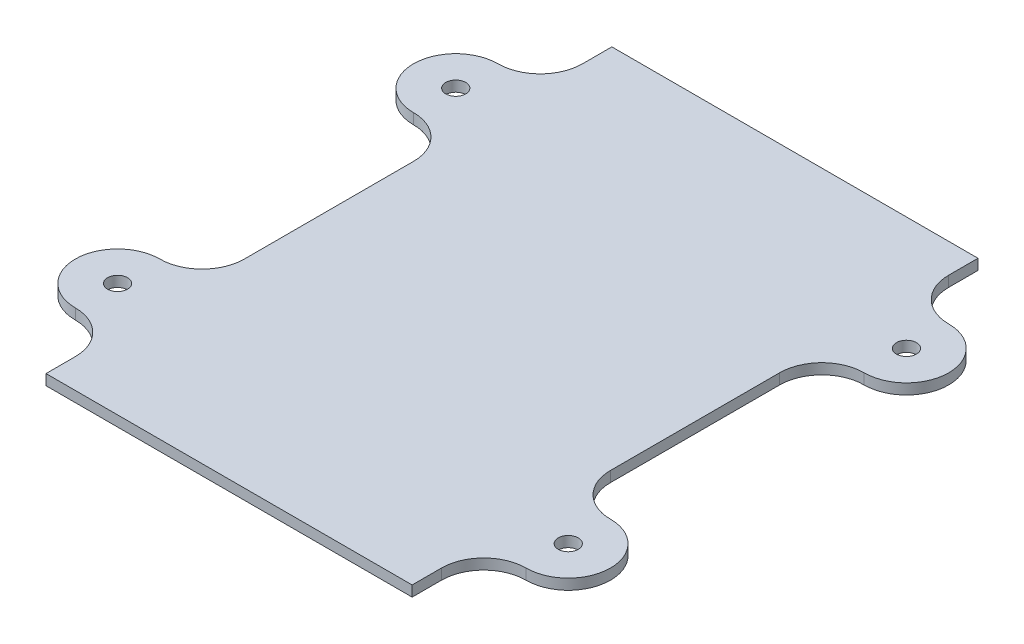
ISO-10303-21;
HEADER;
FILE_DESCRIPTION(('STEP AP214'),'2;1');
FILE_NAME('part.step','',(''),(''),'','','');
FILE_SCHEMA(('AUTOMOTIVE_DESIGN { 1 0 10303 214 1 1 1 1 }'));
ENDSEC;
DATA;
#1=APPLICATION_CONTEXT('core data for automotive mechanical design processes');
#2=APPLICATION_PROTOCOL_DEFINITION('international standard','automotive_design',2000,#1);
#3=PRODUCT_CONTEXT('',#1,'mechanical');
#4=PRODUCT('Part','Part','',(#3));
#5=PRODUCT_RELATED_PRODUCT_CATEGORY('part','',(#4));
#6=PRODUCT_DEFINITION_FORMATION('','',#4);
#7=PRODUCT_DEFINITION_CONTEXT('part definition',#1,'design');
#8=PRODUCT_DEFINITION('design','',#6,#7);
#9=PRODUCT_DEFINITION_SHAPE('','',#8);
#10=(LENGTH_UNIT() NAMED_UNIT(*) SI_UNIT(.MILLI.,.METRE.));
#11=(NAMED_UNIT(*) PLANE_ANGLE_UNIT() SI_UNIT($,.RADIAN.));
#12=(NAMED_UNIT(*) SI_UNIT($,.STERADIAN.) SOLID_ANGLE_UNIT());
#13=UNCERTAINTY_MEASURE_WITH_UNIT(LENGTH_MEASURE(1.E-05),#10,'distance_accuracy_value','');
#14=(GEOMETRIC_REPRESENTATION_CONTEXT(3) GLOBAL_UNCERTAINTY_ASSIGNED_CONTEXT((#13)) GLOBAL_UNIT_ASSIGNED_CONTEXT((#10,
#11,#12)) REPRESENTATION_CONTEXT('',''));
#15=CARTESIAN_POINT('',(0.,0.,0.));
#16=DIRECTION('',(0.,0.,1.));
#17=DIRECTION('',(1.,0.,0.));
#18=AXIS2_PLACEMENT_3D('',#15,#16,#17);
#19=CARTESIAN_POINT('',(-27.5,1.5875,42.5));
#20=DIRECTION('',(1.,0.,0.));
#21=DIRECTION('',(0.,0.,-1.));
#22=AXIS2_PLACEMENT_3D('',#19,#20,#21);
#23=PLANE('',#22);
#24=DIRECTION('',(0.,-1.,0.));
#25=VECTOR('',#24,1.);
#26=CARTESIAN_POINT('',(-27.5,1.5875,-12.7));
#27=LINE('',#26,#25);
#28=CARTESIAN_POINT('',(-27.5,1.5875,-12.7));
#29=VERTEX_POINT('',#28);
#30=CARTESIAN_POINT('',(-27.5,0.,-12.7));
#31=VERTEX_POINT('',#30);
#32=EDGE_CURVE('E197',#29,#31,#27,.T.);
#33=ORIENTED_EDGE('',*,*,#32,.T.);
#34=DIRECTION('',(0.,0.,1.));
#35=VECTOR('',#34,1.);
#36=CARTESIAN_POINT('',(-27.5,0.,42.5));
#37=LINE('',#36,#35);
#38=CARTESIAN_POINT('',(-27.5,0.,12.7));
#39=VERTEX_POINT('',#38);
#40=EDGE_CURVE('E310',#31,#39,#37,.T.);
#41=ORIENTED_EDGE('',*,*,#40,.T.);
#42=DIRECTION('',(0.,-1.,0.));
#43=VECTOR('',#42,1.);
#44=CARTESIAN_POINT('',(-27.5,1.5875,12.7));
#45=LINE('',#44,#43);
#46=CARTESIAN_POINT('',(-27.5,1.5875,12.7));
#47=VERTEX_POINT('',#46);
#48=EDGE_CURVE('E237',#47,#39,#45,.T.);
#49=ORIENTED_EDGE('',*,*,#48,.F.);
#50=DIRECTION('',(0.,0.,1.));
#51=VECTOR('',#50,1.);
#52=CARTESIAN_POINT('',(-27.5,1.5875,42.5));
#53=LINE('',#52,#51);
#54=EDGE_CURVE('E48',#29,#47,#53,.T.);
#55=ORIENTED_EDGE('',*,*,#54,.F.);
#56=EDGE_LOOP('',(#33,#41,#49,#55));
#57=FACE_BOUND('',#56,.T.);
#58=ADVANCED_FACE('F33',(#57),#23,.F.);
#59=CARTESIAN_POINT('',(-27.5,0.,-42.5));
#60=VERTEX_POINT('',#59);
#61=CARTESIAN_POINT('',(-27.5,0.,-38.1));
#62=VERTEX_POINT('',#61);
#63=EDGE_CURVE('E307',#60,#62,#37,.T.);
#64=ORIENTED_EDGE('',*,*,#63,.T.);
#65=DIRECTION('',(0.,-1.,0.));
#66=VECTOR('',#65,1.);
#67=CARTESIAN_POINT('',(-27.5,1.5875,-38.1));
#68=LINE('',#67,#66);
#69=CARTESIAN_POINT('',(-27.5,1.5875,-38.1));
#70=VERTEX_POINT('',#69);
#71=EDGE_CURVE('E56',#70,#62,#68,.T.);
#72=ORIENTED_EDGE('',*,*,#71,.F.);
#73=CARTESIAN_POINT('',(-27.5,1.5875,-42.5));
#74=VERTEX_POINT('',#73);
#75=EDGE_CURVE('E191',#74,#70,#53,.T.);
#76=ORIENTED_EDGE('',*,*,#75,.F.);
#77=DIRECTION('',(0.,-1.,0.));
#78=VECTOR('',#77,1.);
#79=CARTESIAN_POINT('',(-27.5,1.5875,-42.5));
#80=LINE('',#79,#78);
#81=EDGE_CURVE('E41',#74,#60,#80,.T.);
#82=ORIENTED_EDGE('',*,*,#81,.T.);
#83=EDGE_LOOP('',(#64,#72,#76,#82));
#84=FACE_BOUND('',#83,.T.);
#85=ADVANCED_FACE('F339',(#84),#23,.F.);
#86=CARTESIAN_POINT('',(27.5,1.5875,42.5));
#87=DIRECTION('',(-1.,0.,0.));
#88=DIRECTION('',(0.,0.,1.));
#89=AXIS2_PLACEMENT_3D('',#86,#87,#88);
#90=PLANE('',#89);
#91=DIRECTION('',(0.,-1.,0.));
#92=VECTOR('',#91,1.);
#93=CARTESIAN_POINT('',(27.5,1.5875,12.7));
#94=LINE('',#93,#92);
#95=CARTESIAN_POINT('',(27.5,1.5875,12.7));
#96=VERTEX_POINT('',#95);
#97=CARTESIAN_POINT('',(27.5,0.,12.7));
#98=VERTEX_POINT('',#97);
#99=EDGE_CURVE('E257',#96,#98,#94,.T.);
#100=ORIENTED_EDGE('',*,*,#99,.T.);
#101=DIRECTION('',(0.,0.,-1.));
#102=VECTOR('',#101,1.);
#103=CARTESIAN_POINT('',(27.5,0.,42.5));
#104=LINE('',#103,#102);
#105=CARTESIAN_POINT('',(27.5,0.,-12.7));
#106=VERTEX_POINT('',#105);
#107=EDGE_CURVE('E312',#98,#106,#104,.T.);
#108=ORIENTED_EDGE('',*,*,#107,.T.);
#109=DIRECTION('',(0.,-1.,0.));
#110=VECTOR('',#109,1.);
#111=CARTESIAN_POINT('',(27.5,1.5875,-12.7));
#112=LINE('',#111,#110);
#113=CARTESIAN_POINT('',(27.5,1.5875,-12.7));
#114=VERTEX_POINT('',#113);
#115=EDGE_CURVE('E328',#114,#106,#112,.T.);
#116=ORIENTED_EDGE('',*,*,#115,.F.);
#117=DIRECTION('',(0.,0.,-1.));
#118=VECTOR('',#117,1.);
#119=CARTESIAN_POINT('',(27.5,1.5875,42.5));
#120=LINE('',#119,#118);
#121=EDGE_CURVE('E291',#96,#114,#120,.T.);
#122=ORIENTED_EDGE('',*,*,#121,.F.);
#123=EDGE_LOOP('',(#100,#108,#116,#122));
#124=FACE_BOUND('',#123,.T.);
#125=ADVANCED_FACE('F388',(#124),#90,.F.);
#126=CARTESIAN_POINT('',(33.85,1.5875,-12.7));
#127=DIRECTION('',(0.,1.,0.));
#128=DIRECTION('',(0.,0.,1.));
#129=AXIS2_PLACEMENT_3D('',#126,#127,#128);
#130=PLANE('',#129);
#131=CARTESIAN_POINT('',(33.85,1.5875,-38.1));
#132=DIRECTION('',(0.,-1.,0.));
#133=DIRECTION('',(0.,0.,-1.));
#134=AXIS2_PLACEMENT_3D('',#131,#132,#133);
#135=CIRCLE('',#134,6.35);
#136=CARTESIAN_POINT('',(33.85,1.5875,-31.75));
#137=VERTEX_POINT('',#136);
#138=CARTESIAN_POINT('',(27.5,1.5875,-38.1));
#139=VERTEX_POINT('',#138);
#140=EDGE_CURVE('E299',#137,#139,#135,.T.);
#141=ORIENTED_EDGE('',*,*,#140,.T.);
#142=DIRECTION('',(0.,0.,-1.));
#143=VECTOR('',#142,1.);
#144=CARTESIAN_POINT('',(27.5,1.5875,-38.1));
#145=LINE('',#144,#143);
#146=CARTESIAN_POINT('',(27.5,1.5875,-42.5));
#147=VERTEX_POINT('',#146);
#148=EDGE_CURVE('E281',#139,#147,#145,.T.);
#149=ORIENTED_EDGE('',*,*,#148,.T.);
#150=DIRECTION('',(-1.,0.,0.));
#151=VECTOR('',#150,1.);
#152=CARTESIAN_POINT('',(-27.5,1.5875,-42.5));
#153=LINE('',#152,#151);
#154=EDGE_CURVE('E284',#147,#74,#153,.T.);
#155=ORIENTED_EDGE('',*,*,#154,.T.);
#156=ORIENTED_EDGE('',*,*,#75,.T.);
#157=CARTESIAN_POINT('',(-33.85,1.5875,-38.1));
#158=DIRECTION('',(0.,1.,0.));
#159=DIRECTION('',(0.,0.,-1.));
#160=AXIS2_PLACEMENT_3D('',#157,#158,#159);
#161=CIRCLE('',#160,6.35);
#162=CARTESIAN_POINT('',(-33.85,1.5875,-31.75));
#163=VERTEX_POINT('',#162);
#164=EDGE_CURVE('E175',#163,#70,#161,.T.);
#165=ORIENTED_EDGE('',*,*,#164,.F.);
#166=CARTESIAN_POINT('',(-33.85,1.5875,-25.4));
#167=DIRECTION('',(0.,-1.,0.));
#168=DIRECTION('',(0.,0.,-1.));
#169=AXIS2_PLACEMENT_3D('',#166,#167,#168);
#170=CIRCLE('',#169,6.35);
#171=CARTESIAN_POINT('',(-33.85,1.5875,-19.05));
#172=VERTEX_POINT('',#171);
#173=EDGE_CURVE('E189',#172,#163,#170,.T.);
#174=ORIENTED_EDGE('',*,*,#173,.F.);
#175=CARTESIAN_POINT('',(-33.85,1.5875,-12.7));
#176=DIRECTION('',(0.,1.,0.));
#177=DIRECTION('',(0.,0.,1.));
#178=AXIS2_PLACEMENT_3D('',#175,#176,#177);
#179=CIRCLE('',#178,6.35);
#180=EDGE_CURVE('E195',#29,#172,#179,.T.);
#181=ORIENTED_EDGE('',*,*,#180,.F.);
#182=ORIENTED_EDGE('',*,*,#54,.T.);
#183=CARTESIAN_POINT('',(-33.85,1.5875,12.7));
#184=DIRECTION('',(0.,-1.,0.));
#185=DIRECTION('',(0.,0.,-1.));
#186=AXIS2_PLACEMENT_3D('',#183,#184,#185);
#187=CIRCLE('',#186,6.35);
#188=CARTESIAN_POINT('',(-33.85,1.5875,19.05));
#189=VERTEX_POINT('',#188);
#190=EDGE_CURVE('E217',#47,#189,#187,.T.);
#191=ORIENTED_EDGE('',*,*,#190,.T.);
#192=CARTESIAN_POINT('',(-33.85,1.5875,25.4));
#193=DIRECTION('',(0.,1.,0.));
#194=DIRECTION('',(0.,0.,1.));
#195=AXIS2_PLACEMENT_3D('',#192,#193,#194);
#196=CIRCLE('',#195,6.35);
#197=CARTESIAN_POINT('',(-33.85,1.5875,31.75));
#198=VERTEX_POINT('',#197);
#199=EDGE_CURVE('E219',#189,#198,#196,.T.);
#200=ORIENTED_EDGE('',*,*,#199,.T.);
#201=CARTESIAN_POINT('',(-33.85,1.5875,38.1));
#202=DIRECTION('',(0.,-1.,0.));
#203=DIRECTION('',(0.,0.,1.));
#204=AXIS2_PLACEMENT_3D('',#201,#202,#203);
#205=CIRCLE('',#204,6.35);
#206=CARTESIAN_POINT('',(-27.5,1.5875,38.1));
#207=VERTEX_POINT('',#206);
#208=EDGE_CURVE('E222',#198,#207,#205,.T.);
#209=ORIENTED_EDGE('',*,*,#208,.T.);
#210=CARTESIAN_POINT('',(-27.5,1.5875,42.5));
#211=VERTEX_POINT('',#210);
#212=EDGE_CURVE('E287',#207,#211,#53,.T.);
#213=ORIENTED_EDGE('',*,*,#212,.T.);
#214=DIRECTION('',(1.,0.,0.));
#215=VECTOR('',#214,1.);
#216=CARTESIAN_POINT('',(-27.5,1.5875,42.5));
#217=LINE('',#216,#215);
#218=CARTESIAN_POINT('',(27.5,1.5875,42.5));
#219=VERTEX_POINT('',#218);
#220=EDGE_CURVE('E289',#211,#219,#217,.T.);
#221=ORIENTED_EDGE('',*,*,#220,.T.);
#222=CARTESIAN_POINT('',(27.5,1.5875,38.1));
#223=VERTEX_POINT('',#222);
#224=EDGE_CURVE('E292',#219,#223,#120,.T.);
#225=ORIENTED_EDGE('',*,*,#224,.T.);
#226=CARTESIAN_POINT('',(33.85,1.5875,38.1));
#227=DIRECTION('',(0.,1.,0.));
#228=DIRECTION('',(0.,0.,1.));
#229=AXIS2_PLACEMENT_3D('',#226,#227,#228);
#230=CIRCLE('',#229,6.35);
#231=CARTESIAN_POINT('',(33.85,1.5875,31.75));
#232=VERTEX_POINT('',#231);
#233=EDGE_CURVE('E247',#232,#223,#230,.T.);
#234=ORIENTED_EDGE('',*,*,#233,.F.);
#235=CARTESIAN_POINT('',(33.85,1.5875,25.4));
#236=DIRECTION('',(0.,-1.,0.));
#237=DIRECTION('',(0.,0.,1.));
#238=AXIS2_PLACEMENT_3D('',#235,#236,#237);
#239=CIRCLE('',#238,6.35);
#240=CARTESIAN_POINT('',(33.85,1.5875,19.05));
#241=VERTEX_POINT('',#240);
#242=EDGE_CURVE('E250',#241,#232,#239,.T.);
#243=ORIENTED_EDGE('',*,*,#242,.F.);
#244=CARTESIAN_POINT('',(33.85,1.5875,12.7));
#245=DIRECTION('',(0.,1.,0.));
#246=DIRECTION('',(0.,0.,-1.));
#247=AXIS2_PLACEMENT_3D('',#244,#245,#246);
#248=CIRCLE('',#247,6.35);
#249=EDGE_CURVE('E254',#96,#241,#248,.T.);
#250=ORIENTED_EDGE('',*,*,#249,.F.);
#251=ORIENTED_EDGE('',*,*,#121,.T.);
#252=CARTESIAN_POINT('',(33.85,1.5875,-12.7));
#253=DIRECTION('',(0.,-1.,0.));
#254=DIRECTION('',(0.,0.,1.));
#255=AXIS2_PLACEMENT_3D('',#252,#253,#254);
#256=CIRCLE('',#255,6.35);
#257=CARTESIAN_POINT('',(33.85,1.5875,-19.05));
#258=VERTEX_POINT('',#257);
#259=EDGE_CURVE('E295',#114,#258,#256,.T.);
#260=ORIENTED_EDGE('',*,*,#259,.T.);
#261=CARTESIAN_POINT('',(33.85,1.5875,-25.4));
#262=DIRECTION('',(0.,1.,0.));
#263=DIRECTION('',(0.,0.,-1.));
#264=AXIS2_PLACEMENT_3D('',#261,#262,#263);
#265=CIRCLE('',#264,6.35);
#266=EDGE_CURVE('E297',#258,#137,#265,.T.);
#267=ORIENTED_EDGE('',*,*,#266,.T.);
#268=EDGE_LOOP('',(#141,#149,#155,#156,#165,#174,#181,#182,#191,#200,#209,#213,#221,#225,#234,
#243,#250,#251,#260,#267));
#269=FACE_BOUND('',#268,.T.);
#270=CARTESIAN_POINT('',(33.85,1.5875,-25.4));
#271=DIRECTION('',(0.,1.,0.));
#272=DIRECTION('',(0.,0.,1.));
#273=AXIS2_PLACEMENT_3D('',#270,#271,#272);
#274=CIRCLE('',#273,1.5);
#275=CARTESIAN_POINT('',(33.85,1.5875,-23.9));
#276=VERTEX_POINT('',#275);
#277=EDGE_CURVE('E275',#276,#276,#274,.T.);
#278=ORIENTED_EDGE('',*,*,#277,.F.);
#279=EDGE_LOOP('',(#278));
#280=FACE_BOUND('',#279,.T.);
#281=CARTESIAN_POINT('',(33.85,1.5875,25.4));
#282=DIRECTION('',(0.,-1.,0.));
#283=DIRECTION('',(0.,0.,-1.));
#284=AXIS2_PLACEMENT_3D('',#281,#282,#283);
#285=CIRCLE('',#284,1.5);
#286=CARTESIAN_POINT('',(33.85,1.5875,23.9));
#287=VERTEX_POINT('',#286);
#288=EDGE_CURVE('E241',#287,#287,#285,.T.);
#289=ORIENTED_EDGE('',*,*,#288,.T.);
#290=EDGE_LOOP('',(#289));
#291=FACE_BOUND('',#290,.T.);
#292=CARTESIAN_POINT('',(-33.85,1.5875,25.4));
#293=DIRECTION('',(0.,1.,0.));
#294=DIRECTION('',(0.,0.,-1.));
#295=AXIS2_PLACEMENT_3D('',#292,#293,#294);
#296=CIRCLE('',#295,1.5);
#297=CARTESIAN_POINT('',(-33.85,1.5875,23.9));
#298=VERTEX_POINT('',#297);
#299=EDGE_CURVE('E211',#298,#298,#296,.T.);
#300=ORIENTED_EDGE('',*,*,#299,.F.);
#301=EDGE_LOOP('',(#300));
#302=FACE_BOUND('',#301,.T.);
#303=CARTESIAN_POINT('',(-33.85,1.5875,-25.4));
#304=DIRECTION('',(0.,-1.,0.));
#305=DIRECTION('',(0.,0.,1.));
#306=AXIS2_PLACEMENT_3D('',#303,#304,#305);
#307=CIRCLE('',#306,1.5);
#308=CARTESIAN_POINT('',(-33.85,1.5875,-23.9));
#309=VERTEX_POINT('',#308);
#310=EDGE_CURVE('E203',#309,#309,#307,.T.);
#311=ORIENTED_EDGE('',*,*,#310,.T.);
#312=EDGE_LOOP('',(#311));
#313=FACE_BOUND('',#312,.T.);
#314=ADVANCED_FACE('F186',(#269,#280,#291,#302,#313),#130,.T.);
#315=CARTESIAN_POINT('',(33.85,0.,-12.7));
#316=DIRECTION('',(0.,1.,0.));
#317=DIRECTION('',(0.,0.,1.));
#318=AXIS2_PLACEMENT_3D('',#315,#316,#317);
#319=PLANE('',#318);
#320=CARTESIAN_POINT('',(33.85,0.,-12.7));
#321=DIRECTION('',(0.,-1.,0.));
#322=DIRECTION('',(0.,0.,1.));
#323=AXIS2_PLACEMENT_3D('',#320,#321,#322);
#324=CIRCLE('',#323,6.35);
#325=CARTESIAN_POINT('',(33.85,0.,-19.05));
#326=VERTEX_POINT('',#325);
#327=EDGE_CURVE('E315',#106,#326,#324,.T.);
#328=ORIENTED_EDGE('',*,*,#327,.F.);
#329=ORIENTED_EDGE('',*,*,#107,.F.);
#330=CARTESIAN_POINT('',(33.85,0.,12.7));
#331=DIRECTION('',(0.,1.,0.));
#332=DIRECTION('',(0.,0.,-1.));
#333=AXIS2_PLACEMENT_3D('',#330,#331,#332);
#334=CIRCLE('',#333,6.35);
#335=CARTESIAN_POINT('',(33.85,0.,19.05));
#336=VERTEX_POINT('',#335);
#337=EDGE_CURVE('E251',#98,#336,#334,.T.);
#338=ORIENTED_EDGE('',*,*,#337,.T.);
#339=CARTESIAN_POINT('',(33.85,0.,25.4));
#340=DIRECTION('',(0.,-1.,0.));
#341=DIRECTION('',(0.,0.,1.));
#342=AXIS2_PLACEMENT_3D('',#339,#340,#341);
#343=CIRCLE('',#342,6.35);
#344=CARTESIAN_POINT('',(33.85,0.,31.75));
#345=VERTEX_POINT('',#344);
#346=EDGE_CURVE('E260',#336,#345,#343,.T.);
#347=ORIENTED_EDGE('',*,*,#346,.T.);
#348=CARTESIAN_POINT('',(33.85,0.,38.1));
#349=DIRECTION('',(0.,1.,0.));
#350=DIRECTION('',(0.,0.,1.));
#351=AXIS2_PLACEMENT_3D('',#348,#349,#350);
#352=CIRCLE('',#351,6.35);
#353=CARTESIAN_POINT('',(27.5,0.,38.1));
#354=VERTEX_POINT('',#353);
#355=EDGE_CURVE('E244',#345,#354,#352,.T.);
#356=ORIENTED_EDGE('',*,*,#355,.T.);
#357=CARTESIAN_POINT('',(27.5,0.,42.5));
#358=VERTEX_POINT('',#357);
#359=EDGE_CURVE('E313',#358,#354,#104,.T.);
#360=ORIENTED_EDGE('',*,*,#359,.F.);
#361=DIRECTION('',(1.,0.,0.));
#362=VECTOR('',#361,1.);
#363=CARTESIAN_POINT('',(-27.5,0.,42.5));
#364=LINE('',#363,#362);
#365=CARTESIAN_POINT('',(-27.5,0.,42.5));
#366=VERTEX_POINT('',#365);
#367=EDGE_CURVE('E309',#366,#358,#364,.T.);
#368=ORIENTED_EDGE('',*,*,#367,.F.);
#369=CARTESIAN_POINT('',(-27.5,0.,38.1));
#370=VERTEX_POINT('',#369);
#371=EDGE_CURVE('E306',#370,#366,#37,.T.);
#372=ORIENTED_EDGE('',*,*,#371,.F.);
#373=CARTESIAN_POINT('',(-33.85,0.,38.1));
#374=DIRECTION('',(0.,-1.,0.));
#375=DIRECTION('',(0.,0.,1.));
#376=AXIS2_PLACEMENT_3D('',#373,#374,#375);
#377=CIRCLE('',#376,6.35);
#378=CARTESIAN_POINT('',(-33.85,0.,31.75));
#379=VERTEX_POINT('',#378);
#380=EDGE_CURVE('E220',#379,#370,#377,.T.);
#381=ORIENTED_EDGE('',*,*,#380,.F.);
#382=CARTESIAN_POINT('',(-33.85,0.,25.4));
#383=DIRECTION('',(0.,1.,0.));
#384=DIRECTION('',(0.,0.,1.));
#385=AXIS2_PLACEMENT_3D('',#382,#383,#384);
#386=CIRCLE('',#385,6.35);
#387=CARTESIAN_POINT('',(-33.85,0.,19.05));
#388=VERTEX_POINT('',#387);
#389=EDGE_CURVE('E226',#388,#379,#386,.T.);
#390=ORIENTED_EDGE('',*,*,#389,.F.);
#391=CARTESIAN_POINT('',(-33.85,0.,12.7));
#392=DIRECTION('',(0.,-1.,0.));
#393=DIRECTION('',(0.,0.,-1.));
#394=AXIS2_PLACEMENT_3D('',#391,#392,#393);
#395=CIRCLE('',#394,6.35);
#396=EDGE_CURVE('E214',#39,#388,#395,.T.);
#397=ORIENTED_EDGE('',*,*,#396,.F.);
#398=ORIENTED_EDGE('',*,*,#40,.F.);
#399=CARTESIAN_POINT('',(-33.85,0.,-12.7));
#400=DIRECTION('',(0.,1.,0.));
#401=DIRECTION('',(0.,0.,1.));
#402=AXIS2_PLACEMENT_3D('',#399,#400,#401);
#403=CIRCLE('',#402,6.35);
#404=CARTESIAN_POINT('',(-33.85,0.,-19.05));
#405=VERTEX_POINT('',#404);
#406=EDGE_CURVE('E192',#31,#405,#403,.T.);
#407=ORIENTED_EDGE('',*,*,#406,.T.);
#408=CARTESIAN_POINT('',(-33.85,0.,-25.4));
#409=DIRECTION('',(0.,-1.,0.));
#410=DIRECTION('',(0.,0.,-1.));
#411=AXIS2_PLACEMENT_3D('',#408,#409,#410);
#412=CIRCLE('',#411,6.35);
#413=CARTESIAN_POINT('',(-33.85,0.,-31.75));
#414=VERTEX_POINT('',#413);
#415=EDGE_CURVE('E202',#405,#414,#412,.T.);
#416=ORIENTED_EDGE('',*,*,#415,.T.);
#417=CARTESIAN_POINT('',(-33.85,0.,-38.1));
#418=DIRECTION('',(0.,1.,0.));
#419=DIRECTION('',(0.,0.,-1.));
#420=AXIS2_PLACEMENT_3D('',#417,#418,#419);
#421=CIRCLE('',#420,6.35);
#422=EDGE_CURVE('E177',#414,#62,#421,.T.);
#423=ORIENTED_EDGE('',*,*,#422,.T.);
#424=ORIENTED_EDGE('',*,*,#63,.F.);
#425=DIRECTION('',(-1.,0.,0.));
#426=VECTOR('',#425,1.);
#427=CARTESIAN_POINT('',(-27.5,0.,-42.5));
#428=LINE('',#427,#426);
#429=CARTESIAN_POINT('',(27.5,0.,-42.5));
#430=VERTEX_POINT('',#429);
#431=EDGE_CURVE('E304',#430,#60,#428,.T.);
#432=ORIENTED_EDGE('',*,*,#431,.F.);
#433=DIRECTION('',(0.,0.,-1.));
#434=VECTOR('',#433,1.);
#435=CARTESIAN_POINT('',(27.5,0.,-38.1));
#436=LINE('',#435,#434);
#437=CARTESIAN_POINT('',(27.5,0.,-38.1));
#438=VERTEX_POINT('',#437);
#439=EDGE_CURVE('E278',#438,#430,#436,.T.);
#440=ORIENTED_EDGE('',*,*,#439,.F.);
#441=CARTESIAN_POINT('',(33.85,0.,-38.1));
#442=DIRECTION('',(0.,-1.,0.));
#443=DIRECTION('',(0.,0.,-1.));
#444=AXIS2_PLACEMENT_3D('',#441,#442,#443);
#445=CIRCLE('',#444,6.35);
#446=CARTESIAN_POINT('',(33.85,0.,-31.75));
#447=VERTEX_POINT('',#446);
#448=EDGE_CURVE('E285',#447,#438,#445,.T.);
#449=ORIENTED_EDGE('',*,*,#448,.F.);
#450=CARTESIAN_POINT('',(33.85,0.,-25.4));
#451=DIRECTION('',(0.,1.,0.));
#452=DIRECTION('',(0.,0.,-1.));
#453=AXIS2_PLACEMENT_3D('',#450,#451,#452);
#454=CIRCLE('',#453,6.35);
#455=EDGE_CURVE('E317',#326,#447,#454,.T.);
#456=ORIENTED_EDGE('',*,*,#455,.F.);
#457=EDGE_LOOP('',(#328,#329,#338,#347,#356,#360,#368,#372,#381,#390,#397,#398,#407,#416,#423,
#424,#432,#440,#449,#456));
#458=FACE_BOUND('',#457,.T.);
#459=CARTESIAN_POINT('',(33.85,0.,-25.4));
#460=DIRECTION('',(0.,1.,0.));
#461=DIRECTION('',(0.,0.,1.));
#462=AXIS2_PLACEMENT_3D('',#459,#460,#461);
#463=CIRCLE('',#462,1.5);
#464=CARTESIAN_POINT('',(33.85,0.,-23.9));
#465=VERTEX_POINT('',#464);
#466=EDGE_CURVE('E274',#465,#465,#463,.T.);
#467=ORIENTED_EDGE('',*,*,#466,.T.);
#468=EDGE_LOOP('',(#467));
#469=FACE_BOUND('',#468,.T.);
#470=CARTESIAN_POINT('',(33.85,0.,25.4));
#471=DIRECTION('',(0.,-1.,0.));
#472=DIRECTION('',(0.,0.,-1.));
#473=AXIS2_PLACEMENT_3D('',#470,#471,#472);
#474=CIRCLE('',#473,1.5);
#475=CARTESIAN_POINT('',(33.85,0.,23.9));
#476=VERTEX_POINT('',#475);
#477=EDGE_CURVE('E240',#476,#476,#474,.T.);
#478=ORIENTED_EDGE('',*,*,#477,.F.);
#479=EDGE_LOOP('',(#478));
#480=FACE_BOUND('',#479,.T.);
#481=CARTESIAN_POINT('',(-33.85,0.,25.4));
#482=DIRECTION('',(0.,1.,0.));
#483=DIRECTION('',(0.,0.,-1.));
#484=AXIS2_PLACEMENT_3D('',#481,#482,#483);
#485=CIRCLE('',#484,1.5);
#486=CARTESIAN_POINT('',(-33.85,0.,23.9));
#487=VERTEX_POINT('',#486);
#488=EDGE_CURVE('E210',#487,#487,#485,.T.);
#489=ORIENTED_EDGE('',*,*,#488,.T.);
#490=EDGE_LOOP('',(#489));
#491=FACE_BOUND('',#490,.T.);
#492=CARTESIAN_POINT('',(-33.85,0.,-25.4));
#493=DIRECTION('',(0.,-1.,0.));
#494=DIRECTION('',(0.,0.,1.));
#495=AXIS2_PLACEMENT_3D('',#492,#493,#494);
#496=CIRCLE('',#495,1.5);
#497=CARTESIAN_POINT('',(-33.85,0.,-23.9));
#498=VERTEX_POINT('',#497);
#499=EDGE_CURVE('E474',#498,#498,#496,.T.);
#500=ORIENTED_EDGE('',*,*,#499,.F.);
#501=EDGE_LOOP('',(#500));
#502=FACE_BOUND('',#501,.T.);
#503=ADVANCED_FACE('F343',(#458,#469,#480,#491,#502),#319,.F.);
#504=CARTESIAN_POINT('',(27.5,1.5875,-38.1));
#505=DIRECTION('',(-1.,0.,0.));
#506=DIRECTION('',(0.,0.,1.));
#507=AXIS2_PLACEMENT_3D('',#504,#505,#506);
#508=PLANE('',#507);
#509=ORIENTED_EDGE('',*,*,#439,.T.);
#510=DIRECTION('',(0.,-1.,0.));
#511=VECTOR('',#510,1.);
#512=CARTESIAN_POINT('',(27.5,1.5875,-42.5));
#513=LINE('',#512,#511);
#514=EDGE_CURVE('E11',#147,#430,#513,.T.);
#515=ORIENTED_EDGE('',*,*,#514,.F.);
#516=ORIENTED_EDGE('',*,*,#148,.F.);
#517=DIRECTION('',(0.,-1.,0.));
#518=VECTOR('',#517,1.);
#519=CARTESIAN_POINT('',(27.5,1.5875,-38.1));
#520=LINE('',#519,#518);
#521=EDGE_CURVE('E301',#139,#438,#520,.T.);
#522=ORIENTED_EDGE('',*,*,#521,.T.);
#523=EDGE_LOOP('',(#509,#515,#516,#522));
#524=FACE_BOUND('',#523,.T.);
#525=ADVANCED_FACE('F35',(#524),#508,.F.);
#526=CARTESIAN_POINT('',(-27.5,1.5875,-42.5));
#527=DIRECTION('',(0.,0.,1.));
#528=DIRECTION('',(1.,0.,0.));
#529=AXIS2_PLACEMENT_3D('',#526,#527,#528);
#530=PLANE('',#529);
#531=ORIENTED_EDGE('',*,*,#431,.T.);
#532=ORIENTED_EDGE('',*,*,#81,.F.);
#533=ORIENTED_EDGE('',*,*,#154,.F.);
#534=ORIENTED_EDGE('',*,*,#514,.T.);
#535=EDGE_LOOP('',(#531,#532,#533,#534));
#536=FACE_BOUND('',#535,.T.);
#537=ADVANCED_FACE('F404',(#536),#530,.F.);
#538=ORIENTED_EDGE('',*,*,#212,.F.);
#539=DIRECTION('',(0.,-1.,0.));
#540=VECTOR('',#539,1.);
#541=CARTESIAN_POINT('',(-27.5,1.5875,38.1));
#542=LINE('',#541,#540);
#543=EDGE_CURVE('E224',#207,#370,#542,.T.);
#544=ORIENTED_EDGE('',*,*,#543,.T.);
#545=ORIENTED_EDGE('',*,*,#371,.T.);
#546=DIRECTION('',(0.,-1.,0.));
#547=VECTOR('',#546,1.);
#548=CARTESIAN_POINT('',(-27.5,1.5875,42.5));
#549=LINE('',#548,#547);
#550=EDGE_CURVE('E334',#211,#366,#549,.T.);
#551=ORIENTED_EDGE('',*,*,#550,.F.);
#552=EDGE_LOOP('',(#538,#544,#545,#551));
#553=FACE_BOUND('',#552,.T.);
#554=ADVANCED_FACE('F359',(#553),#23,.F.);
#555=CARTESIAN_POINT('',(-27.5,1.5875,42.5));
#556=DIRECTION('',(0.,0.,-1.));
#557=DIRECTION('',(-1.,0.,0.));
#558=AXIS2_PLACEMENT_3D('',#555,#556,#557);
#559=PLANE('',#558);
#560=ORIENTED_EDGE('',*,*,#367,.T.);
#561=DIRECTION('',(0.,-1.,0.));
#562=VECTOR('',#561,1.);
#563=CARTESIAN_POINT('',(27.5,1.5875,42.5));
#564=LINE('',#563,#562);
#565=EDGE_CURVE('E331',#219,#358,#564,.T.);
#566=ORIENTED_EDGE('',*,*,#565,.F.);
#567=ORIENTED_EDGE('',*,*,#220,.F.);
#568=ORIENTED_EDGE('',*,*,#550,.T.);
#569=EDGE_LOOP('',(#560,#566,#567,#568));
#570=FACE_BOUND('',#569,.T.);
#571=ADVANCED_FACE('F365',(#570),#559,.F.);
#572=ORIENTED_EDGE('',*,*,#359,.T.);
#573=DIRECTION('',(0.,-1.,0.));
#574=VECTOR('',#573,1.);
#575=CARTESIAN_POINT('',(27.5,1.5875,38.1));
#576=LINE('',#575,#574);
#577=EDGE_CURVE('E271',#223,#354,#576,.T.);
#578=ORIENTED_EDGE('',*,*,#577,.F.);
#579=ORIENTED_EDGE('',*,*,#224,.F.);
#580=ORIENTED_EDGE('',*,*,#565,.T.);
#581=EDGE_LOOP('',(#572,#578,#579,#580));
#582=FACE_BOUND('',#581,.T.);
#583=ADVANCED_FACE('F370',(#582),#90,.F.);
#584=CARTESIAN_POINT('',(33.85,1.5875,-12.7));
#585=DIRECTION('',(0.,-1.,0.));
#586=DIRECTION('',(0.,0.,-1.));
#587=AXIS2_PLACEMENT_3D('',#584,#585,#586);
#588=CYLINDRICAL_SURFACE('',#587,6.35);
#589=ORIENTED_EDGE('',*,*,#327,.T.);
#590=DIRECTION('',(0.,-1.,0.));
#591=VECTOR('',#590,1.);
#592=CARTESIAN_POINT('',(33.85,1.5875,-19.05));
#593=LINE('',#592,#591);
#594=EDGE_CURVE('E325',#258,#326,#593,.T.);
#595=ORIENTED_EDGE('',*,*,#594,.F.);
#596=ORIENTED_EDGE('',*,*,#259,.F.);
#597=ORIENTED_EDGE('',*,*,#115,.T.);
#598=EDGE_LOOP('',(#589,#595,#596,#597));
#599=FACE_BOUND('',#598,.T.);
#600=ADVANCED_FACE('F390',(#599),#588,.F.);
#601=CARTESIAN_POINT('',(33.85,1.5875,-25.4));
#602=DIRECTION('',(0.,-1.,0.));
#603=DIRECTION('',(0.,0.,-1.));
#604=AXIS2_PLACEMENT_3D('',#601,#602,#603);
#605=CYLINDRICAL_SURFACE('',#604,6.35);
#606=ORIENTED_EDGE('',*,*,#455,.T.);
#607=DIRECTION('',(0.,-1.,0.));
#608=VECTOR('',#607,1.);
#609=CARTESIAN_POINT('',(33.85,1.5875,-31.75));
#610=LINE('',#609,#608);
#611=EDGE_CURVE('E322',#137,#447,#610,.T.);
#612=ORIENTED_EDGE('',*,*,#611,.F.);
#613=ORIENTED_EDGE('',*,*,#266,.F.);
#614=ORIENTED_EDGE('',*,*,#594,.T.);
#615=EDGE_LOOP('',(#606,#612,#613,#614));
#616=FACE_BOUND('',#615,.T.);
#617=ADVANCED_FACE('F395',(#616),#605,.T.);
#618=CARTESIAN_POINT('',(33.85,1.5875,-38.1));
#619=DIRECTION('',(0.,-1.,0.));
#620=DIRECTION('',(0.,0.,-1.));
#621=AXIS2_PLACEMENT_3D('',#618,#619,#620);
#622=CYLINDRICAL_SURFACE('',#621,6.35);
#623=ORIENTED_EDGE('',*,*,#448,.T.);
#624=ORIENTED_EDGE('',*,*,#521,.F.);
#625=ORIENTED_EDGE('',*,*,#140,.F.);
#626=ORIENTED_EDGE('',*,*,#611,.T.);
#627=EDGE_LOOP('',(#623,#624,#625,#626));
#628=FACE_BOUND('',#627,.T.);
#629=ADVANCED_FACE('F401',(#628),#622,.F.);
#630=CARTESIAN_POINT('',(33.85,1.5875,-25.4));
#631=DIRECTION('',(0.,-1.,0.));
#632=DIRECTION('',(0.,0.,-1.));
#633=AXIS2_PLACEMENT_3D('',#630,#631,#632);
#634=CYLINDRICAL_SURFACE('',#633,1.5);
#635=ORIENTED_EDGE('',*,*,#277,.T.);
#636=EDGE_LOOP('',(#635));
#637=FACE_BOUND('',#636,.T.);
#638=ORIENTED_EDGE('',*,*,#466,.F.);
#639=EDGE_LOOP('',(#638));
#640=FACE_BOUND('',#639,.T.);
#641=ADVANCED_FACE('F426',(#637,#640),#634,.F.);
#642=CARTESIAN_POINT('',(33.85,1.5875,38.1));
#643=DIRECTION('',(0.,-1.,0.));
#644=DIRECTION('',(0.,0.,-1.));
#645=AXIS2_PLACEMENT_3D('',#642,#643,#644);
#646=CYLINDRICAL_SURFACE('',#645,6.35);
#647=ORIENTED_EDGE('',*,*,#355,.F.);
#648=DIRECTION('',(0.,-1.,0.));
#649=VECTOR('',#648,1.);
#650=CARTESIAN_POINT('',(33.85,1.5875,31.75));
#651=LINE('',#650,#649);
#652=EDGE_CURVE('E269',#232,#345,#651,.T.);
#653=ORIENTED_EDGE('',*,*,#652,.F.);
#654=ORIENTED_EDGE('',*,*,#233,.T.);
#655=ORIENTED_EDGE('',*,*,#577,.T.);
#656=EDGE_LOOP('',(#647,#653,#654,#655));
#657=FACE_BOUND('',#656,.T.);
#658=ADVANCED_FACE('F373',(#657),#646,.F.);
#659=CARTESIAN_POINT('',(33.85,1.5875,25.4));
#660=DIRECTION('',(0.,-1.,0.));
#661=DIRECTION('',(0.,0.,-1.));
#662=AXIS2_PLACEMENT_3D('',#659,#660,#661);
#663=CYLINDRICAL_SURFACE('',#662,6.35);
#664=ORIENTED_EDGE('',*,*,#346,.F.);
#665=DIRECTION('',(0.,-1.,0.));
#666=VECTOR('',#665,1.);
#667=CARTESIAN_POINT('',(33.85,1.5875,19.05));
#668=LINE('',#667,#666);
#669=EDGE_CURVE('E267',#241,#336,#668,.T.);
#670=ORIENTED_EDGE('',*,*,#669,.F.);
#671=ORIENTED_EDGE('',*,*,#242,.T.);
#672=ORIENTED_EDGE('',*,*,#652,.T.);
#673=EDGE_LOOP('',(#664,#670,#671,#672));
#674=FACE_BOUND('',#673,.T.);
#675=ADVANCED_FACE('F379',(#674),#663,.T.);
#676=CARTESIAN_POINT('',(33.85,1.5875,12.7));
#677=DIRECTION('',(0.,-1.,0.));
#678=DIRECTION('',(0.,0.,-1.));
#679=AXIS2_PLACEMENT_3D('',#676,#677,#678);
#680=CYLINDRICAL_SURFACE('',#679,6.35);
#681=ORIENTED_EDGE('',*,*,#337,.F.);
#682=ORIENTED_EDGE('',*,*,#99,.F.);
#683=ORIENTED_EDGE('',*,*,#249,.T.);
#684=ORIENTED_EDGE('',*,*,#669,.T.);
#685=EDGE_LOOP('',(#681,#682,#683,#684));
#686=FACE_BOUND('',#685,.T.);
#687=ADVANCED_FACE('F382',(#686),#680,.F.);
#688=CARTESIAN_POINT('',(33.85,1.5875,25.4));
#689=DIRECTION('',(0.,-1.,0.));
#690=DIRECTION('',(0.,0.,-1.));
#691=AXIS2_PLACEMENT_3D('',#688,#689,#690);
#692=CYLINDRICAL_SURFACE('',#691,1.5);
#693=ORIENTED_EDGE('',*,*,#288,.F.);
#694=EDGE_LOOP('',(#693));
#695=FACE_BOUND('',#694,.T.);
#696=ORIENTED_EDGE('',*,*,#477,.T.);
#697=EDGE_LOOP('',(#696));
#698=FACE_BOUND('',#697,.T.);
#699=ADVANCED_FACE('F440',(#695,#698),#692,.F.);
#700=CARTESIAN_POINT('',(-33.85,1.5875,12.7));
#701=DIRECTION('',(0.,-1.,0.));
#702=DIRECTION('',(0.,0.,-1.));
#703=AXIS2_PLACEMENT_3D('',#700,#701,#702);
#704=CYLINDRICAL_SURFACE('',#703,6.35);
#705=ORIENTED_EDGE('',*,*,#396,.T.);
#706=DIRECTION('',(0.,-1.,0.));
#707=VECTOR('',#706,1.);
#708=CARTESIAN_POINT('',(-33.85,1.5875,19.05));
#709=LINE('',#708,#707);
#710=EDGE_CURVE('E234',#189,#388,#709,.T.);
#711=ORIENTED_EDGE('',*,*,#710,.F.);
#712=ORIENTED_EDGE('',*,*,#190,.F.);
#713=ORIENTED_EDGE('',*,*,#48,.T.);
#714=EDGE_LOOP('',(#705,#711,#712,#713));
#715=FACE_BOUND('',#714,.T.);
#716=ADVANCED_FACE('F353',(#715),#704,.F.);
#717=CARTESIAN_POINT('',(-33.85,1.5875,25.4));
#718=DIRECTION('',(0.,-1.,0.));
#719=DIRECTION('',(0.,0.,-1.));
#720=AXIS2_PLACEMENT_3D('',#717,#718,#719);
#721=CYLINDRICAL_SURFACE('',#720,6.35);
#722=ORIENTED_EDGE('',*,*,#389,.T.);
#723=DIRECTION('',(0.,-1.,0.));
#724=VECTOR('',#723,1.);
#725=CARTESIAN_POINT('',(-33.85,1.5875,31.75));
#726=LINE('',#725,#724);
#727=EDGE_CURVE('E231',#198,#379,#726,.T.);
#728=ORIENTED_EDGE('',*,*,#727,.F.);
#729=ORIENTED_EDGE('',*,*,#199,.F.);
#730=ORIENTED_EDGE('',*,*,#710,.T.);
#731=EDGE_LOOP('',(#722,#728,#729,#730));
#732=FACE_BOUND('',#731,.T.);
#733=ADVANCED_FACE('F446',(#732),#721,.T.);
#734=CARTESIAN_POINT('',(-33.85,1.5875,38.1));
#735=DIRECTION('',(0.,-1.,0.));
#736=DIRECTION('',(0.,0.,-1.));
#737=AXIS2_PLACEMENT_3D('',#734,#735,#736);
#738=CYLINDRICAL_SURFACE('',#737,6.35);
#739=ORIENTED_EDGE('',*,*,#380,.T.);
#740=ORIENTED_EDGE('',*,*,#543,.F.);
#741=ORIENTED_EDGE('',*,*,#208,.F.);
#742=ORIENTED_EDGE('',*,*,#727,.T.);
#743=EDGE_LOOP('',(#739,#740,#741,#742));
#744=FACE_BOUND('',#743,.T.);
#745=ADVANCED_FACE('F449',(#744),#738,.F.);
#746=CARTESIAN_POINT('',(-33.85,1.5875,25.4));
#747=DIRECTION('',(0.,-1.,0.));
#748=DIRECTION('',(0.,0.,-1.));
#749=AXIS2_PLACEMENT_3D('',#746,#747,#748);
#750=CYLINDRICAL_SURFACE('',#749,1.5);
#751=ORIENTED_EDGE('',*,*,#299,.T.);
#752=EDGE_LOOP('',(#751));
#753=FACE_BOUND('',#752,.T.);
#754=ORIENTED_EDGE('',*,*,#488,.F.);
#755=EDGE_LOOP('',(#754));
#756=FACE_BOUND('',#755,.T.);
#757=ADVANCED_FACE('F453',(#753,#756),#750,.F.);
#758=CARTESIAN_POINT('',(-33.85,1.5875,-38.1));
#759=DIRECTION('',(0.,-1.,0.));
#760=DIRECTION('',(0.,0.,-1.));
#761=AXIS2_PLACEMENT_3D('',#758,#759,#760);
#762=CYLINDRICAL_SURFACE('',#761,6.35);
#763=ORIENTED_EDGE('',*,*,#422,.F.);
#764=DIRECTION('',(0.,-1.,0.));
#765=VECTOR('',#764,1.);
#766=CARTESIAN_POINT('',(-33.85,1.5875,-31.75));
#767=LINE('',#766,#765);
#768=EDGE_CURVE('E172',#163,#414,#767,.T.);
#769=ORIENTED_EDGE('',*,*,#768,.F.);
#770=ORIENTED_EDGE('',*,*,#164,.T.);
#771=ORIENTED_EDGE('',*,*,#71,.T.);
#772=EDGE_LOOP('',(#763,#769,#770,#771));
#773=FACE_BOUND('',#772,.T.);
#774=ADVANCED_FACE('F174',(#773),#762,.F.);
#775=CARTESIAN_POINT('',(-33.85,1.5875,-25.4));
#776=DIRECTION('',(0.,-1.,0.));
#777=DIRECTION('',(0.,0.,-1.));
#778=AXIS2_PLACEMENT_3D('',#775,#776,#777);
#779=CYLINDRICAL_SURFACE('',#778,6.35);
#780=ORIENTED_EDGE('',*,*,#415,.F.);
#781=DIRECTION('',(0.,-1.,0.));
#782=VECTOR('',#781,1.);
#783=CARTESIAN_POINT('',(-33.85,1.5875,-19.05));
#784=LINE('',#783,#782);
#785=EDGE_CURVE('E182',#172,#405,#784,.T.);
#786=ORIENTED_EDGE('',*,*,#785,.F.);
#787=ORIENTED_EDGE('',*,*,#173,.T.);
#788=ORIENTED_EDGE('',*,*,#768,.T.);
#789=EDGE_LOOP('',(#780,#786,#787,#788));
#790=FACE_BOUND('',#789,.T.);
#791=ADVANCED_FACE('F194',(#790),#779,.T.);
#792=CARTESIAN_POINT('',(-33.85,1.5875,-12.7));
#793=DIRECTION('',(0.,-1.,0.));
#794=DIRECTION('',(0.,0.,-1.));
#795=AXIS2_PLACEMENT_3D('',#792,#793,#794);
#796=CYLINDRICAL_SURFACE('',#795,6.35);
#797=ORIENTED_EDGE('',*,*,#406,.F.);
#798=ORIENTED_EDGE('',*,*,#32,.F.);
#799=ORIENTED_EDGE('',*,*,#180,.T.);
#800=ORIENTED_EDGE('',*,*,#785,.T.);
#801=EDGE_LOOP('',(#797,#798,#799,#800));
#802=FACE_BOUND('',#801,.T.);
#803=ADVANCED_FACE('F349',(#802),#796,.F.);
#804=CARTESIAN_POINT('',(-33.85,1.5875,-25.4));
#805=DIRECTION('',(0.,-1.,0.));
#806=DIRECTION('',(0.,0.,-1.));
#807=AXIS2_PLACEMENT_3D('',#804,#805,#806);
#808=CYLINDRICAL_SURFACE('',#807,1.5);
#809=ORIENTED_EDGE('',*,*,#310,.F.);
#810=EDGE_LOOP('',(#809));
#811=FACE_BOUND('',#810,.T.);
#812=ORIENTED_EDGE('',*,*,#499,.T.);
#813=EDGE_LOOP('',(#812));
#814=FACE_BOUND('',#813,.T.);
#815=ADVANCED_FACE('F464',(#811,#814),#808,.F.);
#816=CLOSED_SHELL('',(#58,#85,#125,#314,#503,#525,#537,#554,#571,#583,#600,#617,#629,#641,#658,
#675,#687,#699,#716,#733,#745,#757,#774,#791,#803,#815));
#817=MANIFOLD_SOLID_BREP('B2',#816);
#818=ADVANCED_BREP_SHAPE_REPRESENTATION('',(#18,#817),#14);
#819=SHAPE_DEFINITION_REPRESENTATION(#9,#818);
ENDSEC;
END-ISO-10303-21;
